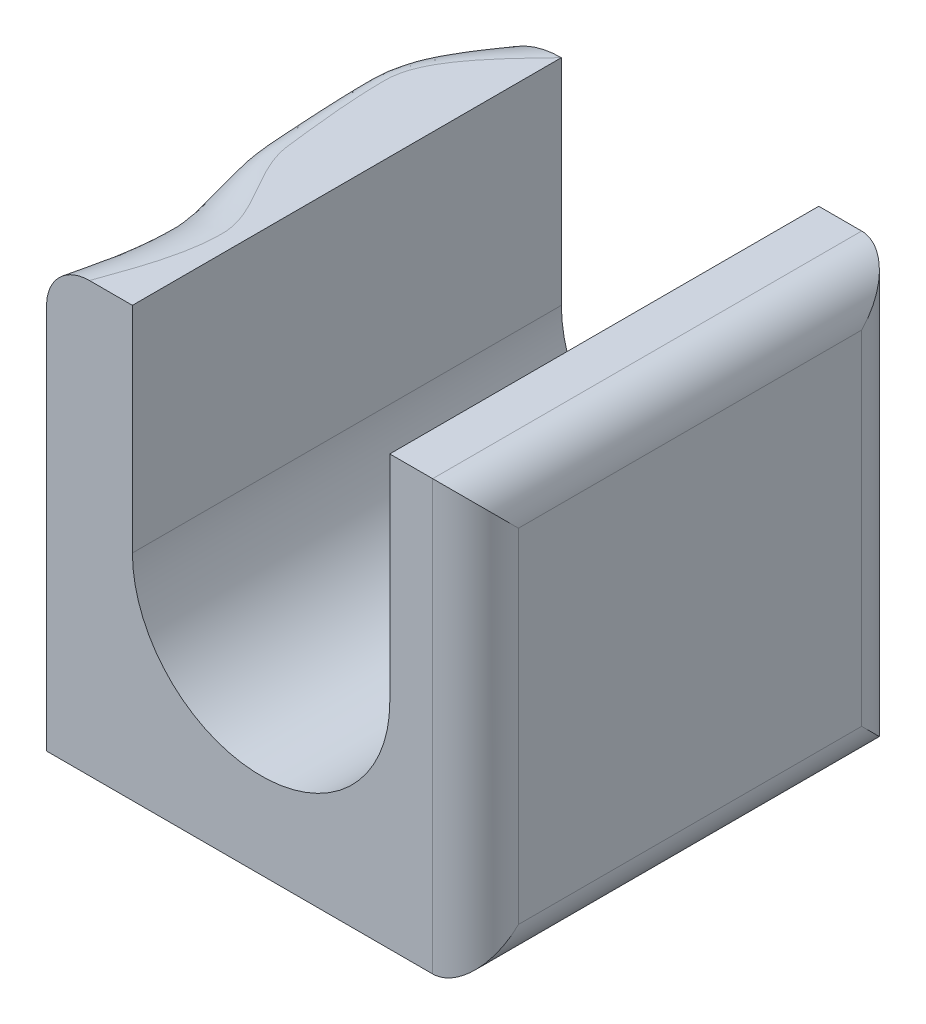
ISO-10303-21;
HEADER;
FILE_DESCRIPTION(('STEP AP214'),'2;1');
FILE_NAME('part.step','',(''),(''),'','','');
FILE_SCHEMA(('AUTOMOTIVE_DESIGN { 1 0 10303 214 1 1 1 1 }'));
ENDSEC;
DATA;
#1=APPLICATION_CONTEXT('core data for automotive mechanical design processes');
#2=APPLICATION_PROTOCOL_DEFINITION('international standard','automotive_design',2000,#1);
#3=PRODUCT_CONTEXT('',#1,'mechanical');
#4=PRODUCT('Part','Part','',(#3));
#5=PRODUCT_RELATED_PRODUCT_CATEGORY('part','',(#4));
#6=PRODUCT_DEFINITION_FORMATION('','',#4);
#7=PRODUCT_DEFINITION_CONTEXT('part definition',#1,'design');
#8=PRODUCT_DEFINITION('design','',#6,#7);
#9=PRODUCT_DEFINITION_SHAPE('','',#8);
#10=(LENGTH_UNIT() NAMED_UNIT(*) SI_UNIT(.MILLI.,.METRE.));
#11=(NAMED_UNIT(*) PLANE_ANGLE_UNIT() SI_UNIT($,.RADIAN.));
#12=(NAMED_UNIT(*) SI_UNIT($,.STERADIAN.) SOLID_ANGLE_UNIT());
#13=UNCERTAINTY_MEASURE_WITH_UNIT(LENGTH_MEASURE(1.E-05),#10,'distance_accuracy_value','');
#14=(GEOMETRIC_REPRESENTATION_CONTEXT(3) GLOBAL_UNCERTAINTY_ASSIGNED_CONTEXT((#13)) GLOBAL_UNIT_ASSIGNED_CONTEXT((#10,
#11,#12)) REPRESENTATION_CONTEXT('',''));
#15=CARTESIAN_POINT('',(0.,0.,0.));
#16=DIRECTION('',(0.,0.,1.));
#17=DIRECTION('',(1.,0.,0.));
#18=AXIS2_PLACEMENT_3D('',#15,#16,#17);
#19=CARTESIAN_POINT('',(0.,25.,50.));
#20=DIRECTION('',(0.,0.,-1.));
#21=DIRECTION('',(-1.,0.,0.));
#22=AXIS2_PLACEMENT_3D('',#19,#20,#21);
#23=CYLINDRICAL_SURFACE('',#22,15.);
#24=DIRECTION('',(0.,0.,1.));
#25=VECTOR('',#24,1.);
#26=CARTESIAN_POINT('',(-15.,25.,50.));
#27=LINE('',#26,#25);
#28=CARTESIAN_POINT('',(-15.,25.,50.));
#29=VERTEX_POINT('',#28);
#30=CARTESIAN_POINT('',(-15.,25.,0.));
#31=VERTEX_POINT('',#30);
#32=EDGE_CURVE('E167',#29,#31,#27,.F.);
#33=ORIENTED_EDGE('',*,*,#32,.F.);
#34=CARTESIAN_POINT('',(0.,25.,50.));
#35=DIRECTION('',(0.,0.,1.));
#36=DIRECTION('',(1.,0.,0.));
#37=AXIS2_PLACEMENT_3D('',#34,#35,#36);
#38=CIRCLE('',#37,15.);
#39=CARTESIAN_POINT('',(15.,25.,50.));
#40=VERTEX_POINT('',#39);
#41=EDGE_CURVE('E183',#29,#40,#38,.T.);
#42=ORIENTED_EDGE('',*,*,#41,.T.);
#43=DIRECTION('',(0.,0.,1.));
#44=VECTOR('',#43,1.);
#45=CARTESIAN_POINT('',(15.,25.,50.));
#46=LINE('',#45,#44);
#47=CARTESIAN_POINT('',(15.,25.,0.));
#48=VERTEX_POINT('',#47);
#49=EDGE_CURVE('E180',#48,#40,#46,.T.);
#50=ORIENTED_EDGE('',*,*,#49,.F.);
#51=CARTESIAN_POINT('',(0.,25.,0.));
#52=DIRECTION('',(0.,0.,1.));
#53=DIRECTION('',(1.,0.,0.));
#54=AXIS2_PLACEMENT_3D('',#51,#52,#53);
#55=CIRCLE('',#54,15.);
#56=EDGE_CURVE('E185',#48,#31,#55,.F.);
#57=ORIENTED_EDGE('',*,*,#56,.T.);
#58=EDGE_LOOP('',(#33,#42,#50,#57));
#59=FACE_BOUND('',#58,.T.);
#60=ADVANCED_FACE('F36',(#59),#23,.F.);
#61=CARTESIAN_POINT('',(-25.,50.,50.));
#62=DIRECTION('',(1.,0.,0.));
#63=DIRECTION('',(0.,1.,0.));
#64=AXIS2_PLACEMENT_3D('',#61,#62,#63);
#65=PLANE('',#64);
#66=DIRECTION('',(0.,-1.,0.));
#67=VECTOR('',#66,1.);
#68=CARTESIAN_POINT('',(-25.,50.,50.));
#69=LINE('',#68,#67);
#70=CARTESIAN_POINT('',(-25.,45.,50.));
#71=VERTEX_POINT('',#70);
#72=CARTESIAN_POINT('',(-25.,0.,50.));
#73=VERTEX_POINT('',#72);
#74=EDGE_CURVE('E120',#71,#73,#69,.T.);
#75=ORIENTED_EDGE('',*,*,#74,.F.);
#76=CARTESIAN_POINT('',(-25.,50.,63.8888888888889));
#77=CARTESIAN_POINT('',(-25.,48.3333333333333,59.2592592592593));
#78=CARTESIAN_POINT('',(-25.,46.6666666666667,54.6296296296296));
#79=CARTESIAN_POINT('',(-25.,45.,50.));
#80=CARTESIAN_POINT('',(-25.,43.5,45.8333333333333));
#81=CARTESIAN_POINT('',(-25.,42.,41.6666666666667));
#82=CARTESIAN_POINT('',(-25.,42.,37.5));
#83=CARTESIAN_POINT('',(-25.,42.,33.3333333333334));
#84=CARTESIAN_POINT('',(-25.,46.5,29.1666666666667));
#85=CARTESIAN_POINT('',(-25.,47.,25.));
#86=CARTESIAN_POINT('',(-25.,47.5,20.8333333333333));
#87=CARTESIAN_POINT('',(-25.,48.,16.6666666666667));
#88=CARTESIAN_POINT('',(-25.,48.,12.5));
#89=CARTESIAN_POINT('',(-25.,48.,8.33333333333334));
#90=CARTESIAN_POINT('',(-25.,44.,4.16666666666668));
#91=CARTESIAN_POINT('',(-25.,40.,0.));
#92=CARTESIAN_POINT('',(-25.,7.99999999999995,-33.3333333333333));
#93=CARTESIAN_POINT('',(-25.,-24.0000000000001,-66.6666666666666));
#94=CARTESIAN_POINT('',(-25.,-56.0000000000001,-99.9999999999999));
#95=(BOUNDED_CURVE() B_SPLINE_CURVE(3,(#76,#77,#78,#79,#80,#81,#82,#83,#84,#85,#86,#87,#88,#89,
#90,#91,#92,#93,#94),.UNSPECIFIED.,.F.,.F.) B_SPLINE_CURVE_WITH_KNOTS((4,3,3,3,3,3,4),
(-0.0138888888888889,0.,0.0125,0.025,0.0375,0.05,0.15),
.UNSPECIFIED.) CURVE() GEOMETRIC_REPRESENTATION_ITEM() RATIONAL_B_SPLINE_CURVE((1.,1.,1.,1.,1.,
1.,1.,1.,1.,1.,1.,1.,1.,1.,1.,1.,1.,1.,1.)) REPRESENTATION_ITEM(''));
#96=CARTESIAN_POINT('',(-25.,40.,0.));
#97=VERTEX_POINT('',#96);
#98=EDGE_CURVE('E187',#71,#97,#95,.T.);
#99=ORIENTED_EDGE('',*,*,#98,.T.);
#100=DIRECTION('',(0.,-1.,0.));
#101=VECTOR('',#100,1.);
#102=CARTESIAN_POINT('',(-25.,50.,0.));
#103=LINE('',#102,#101);
#104=CARTESIAN_POINT('',(-25.,0.,0.));
#105=VERTEX_POINT('',#104);
#106=EDGE_CURVE('E142',#97,#105,#103,.T.);
#107=ORIENTED_EDGE('',*,*,#106,.T.);
#108=DIRECTION('',(0.,0.,-1.));
#109=VECTOR('',#108,1.);
#110=CARTESIAN_POINT('',(-25.,0.,50.));
#111=LINE('',#110,#109);
#112=EDGE_CURVE('E135',#73,#105,#111,.T.);
#113=ORIENTED_EDGE('',*,*,#112,.F.);
#114=EDGE_LOOP('',(#75,#99,#107,#113));
#115=FACE_BOUND('',#114,.T.);
#116=ADVANCED_FACE('F140',(#115),#65,.F.);
#117=CARTESIAN_POINT('',(-25.,0.,50.));
#118=DIRECTION('',(0.,1.,0.));
#119=DIRECTION('',(-1.,0.,0.));
#120=AXIS2_PLACEMENT_3D('',#117,#118,#119);
#121=PLANE('',#120);
#122=DIRECTION('',(1.,0.,0.));
#123=VECTOR('',#122,1.);
#124=CARTESIAN_POINT('',(-25.,0.,0.));
#125=LINE('',#124,#123);
#126=CARTESIAN_POINT('',(20.,0.,0.));
#127=VERTEX_POINT('',#126);
#128=EDGE_CURVE('E265',#105,#127,#125,.T.);
#129=ORIENTED_EDGE('',*,*,#128,.T.);
#130=DIRECTION('',(0.,0.,-1.));
#131=VECTOR('',#130,1.);
#132=CARTESIAN_POINT('',(20.,0.,50.));
#133=LINE('',#132,#131);
#134=CARTESIAN_POINT('',(20.,0.,50.));
#135=VERTEX_POINT('',#134);
#136=EDGE_CURVE('E137',#127,#135,#133,.F.);
#137=ORIENTED_EDGE('',*,*,#136,.T.);
#138=DIRECTION('',(1.,0.,0.));
#139=VECTOR('',#138,1.);
#140=CARTESIAN_POINT('',(-25.,0.,50.));
#141=LINE('',#140,#139);
#142=EDGE_CURVE('E123',#73,#135,#141,.T.);
#143=ORIENTED_EDGE('',*,*,#142,.F.);
#144=ORIENTED_EDGE('',*,*,#112,.T.);
#145=EDGE_LOOP('',(#129,#137,#143,#144));
#146=FACE_BOUND('',#145,.T.);
#147=ADVANCED_FACE('F134',(#146),#121,.F.);
#148=CARTESIAN_POINT('',(25.,0.,50.));
#149=DIRECTION('',(-1.,0.,0.));
#150=DIRECTION('',(0.,0.,1.));
#151=AXIS2_PLACEMENT_3D('',#148,#149,#150);
#152=PLANE('',#151);
#153=DIRECTION('',(0.,1.,0.));
#154=VECTOR('',#153,1.);
#155=CARTESIAN_POINT('',(25.,0.,45.));
#156=LINE('',#155,#154);
#157=CARTESIAN_POINT('',(25.,45.,45.));
#158=VERTEX_POINT('',#157);
#159=CARTESIAN_POINT('',(25.,5.,45.));
#160=VERTEX_POINT('',#159);
#161=EDGE_CURVE('E155',#158,#160,#156,.F.);
#162=ORIENTED_EDGE('',*,*,#161,.T.);
#163=DIRECTION('',(0.,0.,-1.));
#164=VECTOR('',#163,1.);
#165=CARTESIAN_POINT('',(25.,5.,50.));
#166=LINE('',#165,#164);
#167=CARTESIAN_POINT('',(25.,5.,5.));
#168=VERTEX_POINT('',#167);
#169=EDGE_CURVE('E157',#160,#168,#166,.T.);
#170=ORIENTED_EDGE('',*,*,#169,.T.);
#171=DIRECTION('',(0.,1.,0.));
#172=VECTOR('',#171,1.);
#173=CARTESIAN_POINT('',(25.,0.,5.));
#174=LINE('',#173,#172);
#175=CARTESIAN_POINT('',(25.,45.,5.));
#176=VERTEX_POINT('',#175);
#177=EDGE_CURVE('E144',#168,#176,#174,.T.);
#178=ORIENTED_EDGE('',*,*,#177,.T.);
#179=DIRECTION('',(0.,0.,-1.));
#180=VECTOR('',#179,1.);
#181=CARTESIAN_POINT('',(25.,45.,50.));
#182=LINE('',#181,#180);
#183=EDGE_CURVE('E147',#176,#158,#182,.F.);
#184=ORIENTED_EDGE('',*,*,#183,.T.);
#185=EDGE_LOOP('',(#162,#170,#178,#184));
#186=FACE_BOUND('',#185,.T.);
#187=ADVANCED_FACE('F222',(#186),#152,.F.);
#188=CARTESIAN_POINT('',(25.,50.,50.));
#189=DIRECTION('',(0.,-1.,0.));
#190=DIRECTION('',(0.,0.,-1.));
#191=AXIS2_PLACEMENT_3D('',#188,#189,#190);
#192=PLANE('',#191);
#193=DIRECTION('',(-1.,0.,0.));
#194=VECTOR('',#193,1.);
#195=CARTESIAN_POINT('',(25.,50.,50.));
#196=LINE('',#195,#194);
#197=CARTESIAN_POINT('',(20.,50.,50.));
#198=VERTEX_POINT('',#197);
#199=CARTESIAN_POINT('',(15.,50.,50.));
#200=VERTEX_POINT('',#199);
#201=EDGE_CURVE('E138',#198,#200,#196,.T.);
#202=ORIENTED_EDGE('',*,*,#201,.F.);
#203=DIRECTION('',(0.,0.,-1.));
#204=VECTOR('',#203,1.);
#205=CARTESIAN_POINT('',(20.,50.,50.));
#206=LINE('',#205,#204);
#207=CARTESIAN_POINT('',(20.,50.,0.));
#208=VERTEX_POINT('',#207);
#209=EDGE_CURVE('E163',#198,#208,#206,.T.);
#210=ORIENTED_EDGE('',*,*,#209,.T.);
#211=DIRECTION('',(-1.,0.,0.));
#212=VECTOR('',#211,1.);
#213=CARTESIAN_POINT('',(25.,50.,0.));
#214=LINE('',#213,#212);
#215=CARTESIAN_POINT('',(15.,50.,0.));
#216=VERTEX_POINT('',#215);
#217=EDGE_CURVE('E267',#208,#216,#214,.T.);
#218=ORIENTED_EDGE('',*,*,#217,.T.);
#219=DIRECTION('',(0.,0.,-1.));
#220=VECTOR('',#219,1.);
#221=CARTESIAN_POINT('',(15.,50.,50.));
#222=LINE('',#221,#220);
#223=EDGE_CURVE('E145',#200,#216,#222,.T.);
#224=ORIENTED_EDGE('',*,*,#223,.F.);
#225=EDGE_LOOP('',(#202,#210,#218,#224));
#226=FACE_BOUND('',#225,.T.);
#227=ADVANCED_FACE('F218',(#226),#192,.F.);
#228=CARTESIAN_POINT('',(15.,50.,50.));
#229=DIRECTION('',(1.,0.,0.));
#230=DIRECTION('',(0.,1.,0.));
#231=AXIS2_PLACEMENT_3D('',#228,#229,#230);
#232=PLANE('',#231);
#233=DIRECTION('',(0.,-1.,0.));
#234=VECTOR('',#233,1.);
#235=CARTESIAN_POINT('',(15.,50.,0.));
#236=LINE('',#235,#234);
#237=EDGE_CURVE('E269',#216,#48,#236,.T.);
#238=ORIENTED_EDGE('',*,*,#237,.T.);
#239=ORIENTED_EDGE('',*,*,#49,.T.);
#240=DIRECTION('',(0.,-1.,0.));
#241=VECTOR('',#240,1.);
#242=CARTESIAN_POINT('',(15.,50.,50.));
#243=LINE('',#242,#241);
#244=EDGE_CURVE('E257',#200,#40,#243,.T.);
#245=ORIENTED_EDGE('',*,*,#244,.F.);
#246=ORIENTED_EDGE('',*,*,#223,.T.);
#247=EDGE_LOOP('',(#238,#239,#245,#246));
#248=FACE_BOUND('',#247,.T.);
#249=ADVANCED_FACE('F214',(#248),#232,.F.);
#250=CARTESIAN_POINT('',(-15.,10.,50.));
#251=DIRECTION('',(-1.,0.,0.));
#252=DIRECTION('',(0.,-1.,0.));
#253=AXIS2_PLACEMENT_3D('',#250,#251,#252);
#254=PLANE('',#253);
#255=DIRECTION('',(0.,1.,0.));
#256=VECTOR('',#255,1.);
#257=CARTESIAN_POINT('',(-15.,10.,50.));
#258=LINE('',#257,#256);
#259=CARTESIAN_POINT('',(-15.,50.,50.));
#260=VERTEX_POINT('',#259);
#261=EDGE_CURVE('E255',#29,#260,#258,.T.);
#262=ORIENTED_EDGE('',*,*,#261,.F.);
#263=ORIENTED_EDGE('',*,*,#32,.T.);
#264=DIRECTION('',(0.,1.,0.));
#265=VECTOR('',#264,1.);
#266=CARTESIAN_POINT('',(-15.,10.,0.));
#267=LINE('',#266,#265);
#268=CARTESIAN_POINT('',(-15.,50.,0.));
#269=VERTEX_POINT('',#268);
#270=EDGE_CURVE('E128',#31,#269,#267,.T.);
#271=ORIENTED_EDGE('',*,*,#270,.T.);
#272=DIRECTION('',(0.,0.,-1.));
#273=VECTOR('',#272,1.);
#274=CARTESIAN_POINT('',(-15.,50.,50.));
#275=LINE('',#274,#273);
#276=EDGE_CURVE('E150',#260,#269,#275,.T.);
#277=ORIENTED_EDGE('',*,*,#276,.F.);
#278=EDGE_LOOP('',(#262,#263,#271,#277));
#279=FACE_BOUND('',#278,.T.);
#280=ADVANCED_FACE('F211',(#279),#254,.F.);
#281=CARTESIAN_POINT('',(-15.,50.,50.));
#282=DIRECTION('',(0.,-1.,0.));
#283=DIRECTION('',(1.,0.,0.));
#284=AXIS2_PLACEMENT_3D('',#281,#282,#283);
#285=PLANE('',#284);
#286=ORIENTED_EDGE('',*,*,#276,.T.);
#287=CARTESIAN_POINT('',(-25.,50.,63.8888888888889));
#288=CARTESIAN_POINT('',(-23.3333333333334,50.,59.2592592592593));
#289=CARTESIAN_POINT('',(-21.6666666666667,50.,54.6296296296296));
#290=CARTESIAN_POINT('',(-20.,50.,50.));
#291=CARTESIAN_POINT('',(-18.5,50.,45.8333333333333));
#292=CARTESIAN_POINT('',(-17.,50.,41.6666666666667));
#293=CARTESIAN_POINT('',(-17.,50.,37.5));
#294=CARTESIAN_POINT('',(-17.,50.,33.3333333333333));
#295=CARTESIAN_POINT('',(-21.5,50.,29.1666666666667));
#296=CARTESIAN_POINT('',(-22.,50.,25.));
#297=CARTESIAN_POINT('',(-22.5,50.,20.8333333333333));
#298=CARTESIAN_POINT('',(-23.,50.,16.6666666666667));
#299=CARTESIAN_POINT('',(-23.,50.,12.5));
#300=CARTESIAN_POINT('',(-23.,50.,8.33333333333334));
#301=CARTESIAN_POINT('',(-19.,50.,4.16666666666667));
#302=CARTESIAN_POINT('',(-15.,50.,0.));
#303=CARTESIAN_POINT('',(17.,50.,-33.3333333333333));
#304=CARTESIAN_POINT('',(49.0000000000001,50.,-66.6666666666667));
#305=CARTESIAN_POINT('',(81.0000000000001,49.9999999999999,-100.));
#306=(BOUNDED_CURVE() B_SPLINE_CURVE(3,(#287,#288,#289,#290,#291,#292,#293,#294,#295,#296,#297,
#298,#299,#300,#301,#302,#303,#304,#305),.UNSPECIFIED.,.F.,.F.) B_SPLINE_CURVE_WITH_KNOTS((4,3,
3,3,3,3,4),(-0.0138888888888889,0.,0.0125,0.025,0.0375,0.05,0.15),
.UNSPECIFIED.) CURVE() GEOMETRIC_REPRESENTATION_ITEM() RATIONAL_B_SPLINE_CURVE((1.,1.,1.,1.,1.,
1.,1.,1.,1.,1.,1.,1.,1.,1.,1.,1.,1.,1.,1.)) REPRESENTATION_ITEM(''));
#307=CARTESIAN_POINT('',(-20.,50.,50.));
#308=VERTEX_POINT('',#307);
#309=EDGE_CURVE('E51',#269,#308,#306,.F.);
#310=ORIENTED_EDGE('',*,*,#309,.T.);
#311=DIRECTION('',(-1.,0.,0.));
#312=VECTOR('',#311,1.);
#313=CARTESIAN_POINT('',(-15.,50.,50.));
#314=LINE('',#313,#312);
#315=EDGE_CURVE('E256',#260,#308,#314,.T.);
#316=ORIENTED_EDGE('',*,*,#315,.F.);
#317=EDGE_LOOP('',(#286,#310,#316));
#318=FACE_BOUND('',#317,.T.);
#319=ADVANCED_FACE('F208',(#318),#285,.F.);
#320=CARTESIAN_POINT('',(0.,0.,50.));
#321=DIRECTION('',(0.,0.,1.));
#322=DIRECTION('',(1.,0.,0.));
#323=AXIS2_PLACEMENT_3D('',#320,#321,#322);
#324=PLANE('',#323);
#325=ORIENTED_EDGE('',*,*,#315,.T.);
#326=CARTESIAN_POINT('',(-20.,50.,50.));
#327=CARTESIAN_POINT('',(-20.1406302948176,50.0000151222911,50.));
#328=CARTESIAN_POINT('',(-20.2812584191292,49.9940675708119,50.));
#329=CARTESIAN_POINT('',(-20.561508506468,49.9703563419424,50.));
#330=CARTESIAN_POINT('',(-20.7011305174357,49.9525932313667,50.));
#331=CARTESIAN_POINT('',(-20.9782754929708,49.9053779316095,50.));
#332=CARTESIAN_POINT('',(-21.1157999638964,49.8759345850441,50.));
#333=CARTESIAN_POINT('',(-21.3878795188578,49.8055729963046,50.));
#334=CARTESIAN_POINT('',(-21.5224346391194,49.7646548942048,50.));
#335=CARTESIAN_POINT('',(-21.7876613959129,49.671618959448,50.));
#336=CARTESIAN_POINT('',(-21.918331844902,49.619497741274,50.));
#337=CARTESIAN_POINT('',(-22.1748654223634,49.5044123927522,50.));
#338=CARTESIAN_POINT('',(-22.3007267560196,49.4414442615863,50.));
#339=CARTESIAN_POINT('',(-22.5466286145503,49.3051634189843,50.));
#340=CARTESIAN_POINT('',(-22.6666722753307,49.2318563657864,50.));
#341=CARTESIAN_POINT('',(-22.9002023090491,49.0753638289856,50.));
#342=CARTESIAN_POINT('',(-23.0136862505309,48.9921747169174,50.));
#343=CARTESIAN_POINT('',(-23.2332001524479,48.8165646353152,50.));
#344=CARTESIAN_POINT('',(-23.3392329294235,48.7241471864227,50.));
#345=CARTESIAN_POINT('',(-23.5431765690898,48.5306746237598,50.));
#346=CARTESIAN_POINT('',(-23.6410843914719,48.4296163050919,50.));
#347=CARTESIAN_POINT('',(-23.8280220654628,48.2196279177911,50.));
#348=CARTESIAN_POINT('',(-23.9170534060811,48.1106991747091,50.));
#349=CARTESIAN_POINT('',(-24.085653982954,47.8856892756899,50.));
#350=CARTESIAN_POINT('',(-24.1652198430642,47.7696055900085,50.));
#351=CARTESIAN_POINT('',(-24.3142879345645,47.5311441540488,50.));
#352=CARTESIAN_POINT('',(-24.3837900044251,47.4087663027883,50.));
#353=CARTESIAN_POINT('',(-24.5122347393422,47.1585900176992,50.));
#354=CARTESIAN_POINT('',(-24.5711773592955,47.0307915607201,50.));
#355=CARTESIAN_POINT('',(-24.6780583372075,46.7707395834761,50.));
#356=CARTESIAN_POINT('',(-24.7260019741572,46.6384882354878,50.));
#357=CARTESIAN_POINT('',(-24.8105693378674,46.370466334796,50.));
#358=CARTESIAN_POINT('',(-24.8471955295688,46.2346965553993,50.));
#359=CARTESIAN_POINT('',(-24.9185512610603,45.9175367913489,50.));
#360=CARTESIAN_POINT('',(-24.9490935277039,45.7351774636814,50.));
#361=CARTESIAN_POINT('',(-24.9796338141004,45.4601744543481,50.));
#362=CARTESIAN_POINT('',(-24.9872683838864,45.3683094917779,50.));
#363=CARTESIAN_POINT('',(-24.9974508638736,45.1843038851057,50.));
#364=CARTESIAN_POINT('',(-24.9999990959729,45.0921632588193,50.));
#365=CARTESIAN_POINT('',(-25.,45.,50.));
#366=B_SPLINE_CURVE_WITH_KNOTS('',3,(#326,#327,#328,#329,#330,#331,#332,#333,#334,#335,#336,
#337,#338,#339,#340,#341,#342,#343,#344,#345,#346,#347,#348,#349,#350,#351,#352,#353,#354,#355,
#356,#357,#358,#359,#360,#361,#362,#363,#364,#365),.UNSPECIFIED.,.F.,.F.,(4,2,2,2,2,2,2,2,2,2,2,
2,2,2,2,2,2,2,2,4),(0.,0.421762112775048,0.843503994291284,1.26492720019982,1.68634526194463,
2.10789085328559,2.52959226339223,2.95106377581668,3.37269052405383,3.79415703039966,
4.21578054241655,4.63733320863876,5.05903578616029,5.48074513149375,5.90245627805925,
6.32396459781569,6.74538104819376,7.29879231272512,7.57521919596946,7.85162858447806),.UNSPECIFIED.);
#367=EDGE_CURVE('E12',#308,#71,#366,.T.);
#368=ORIENTED_EDGE('',*,*,#367,.T.);
#369=ORIENTED_EDGE('',*,*,#74,.T.);
#370=ORIENTED_EDGE('',*,*,#142,.T.);
#371=DIRECTION('',(0.,1.,0.));
#372=VECTOR('',#371,1.);
#373=CARTESIAN_POINT('',(20.,50.,50.));
#374=LINE('',#373,#372);
#375=EDGE_CURVE('E161',#135,#198,#374,.T.);
#376=ORIENTED_EDGE('',*,*,#375,.T.);
#377=ORIENTED_EDGE('',*,*,#201,.T.);
#378=ORIENTED_EDGE('',*,*,#244,.T.);
#379=ORIENTED_EDGE('',*,*,#41,.F.);
#380=ORIENTED_EDGE('',*,*,#261,.T.);
#381=EDGE_LOOP('',(#325,#368,#369,#370,#376,#377,#378,#379,#380));
#382=FACE_BOUND('',#381,.T.);
#383=ADVANCED_FACE('F122',(#382),#324,.T.);
#384=CARTESIAN_POINT('',(0.,0.,0.));
#385=DIRECTION('',(0.,0.,1.));
#386=DIRECTION('',(1.,0.,0.));
#387=AXIS2_PLACEMENT_3D('',#384,#385,#386);
#388=PLANE('',#387);
#389=ORIENTED_EDGE('',*,*,#106,.F.);
#390=CARTESIAN_POINT('',(-25.,40.,0.));
#391=CARTESIAN_POINT('',(-25.0000184716146,40.2485945690824,0.));
#392=CARTESIAN_POINT('',(-24.9907308615319,40.4971868118128,0.));
#393=CARTESIAN_POINT('',(-24.9536768025844,40.9929819486807,0.));
#394=CARTESIAN_POINT('',(-24.925910996368,41.2401848908349,0.));
#395=CARTESIAN_POINT('',(-24.8520628992933,41.7316409080631,0.));
#396=CARTESIAN_POINT('',(-24.8059950288092,41.9758961499133,0.));
#397=CARTESIAN_POINT('',(-24.6958042040687,42.4602989180155,0.));
#398=CARTESIAN_POINT('',(-24.6316812804001,42.7004464512258,0.));
#399=CARTESIAN_POINT('',(-24.4857281519809,43.1753221449206,0.));
#400=CARTESIAN_POINT('',(-24.4038963959466,43.4100498286347,0.));
#401=CARTESIAN_POINT('',(-24.2229529545884,43.8728399329942,0.));
#402=CARTESIAN_POINT('',(-24.1238353582971,44.1009000423838,0.));
#403=CARTESIAN_POINT('',(-23.9088778541098,44.5490279457088,0.));
#404=CARTESIAN_POINT('',(-23.7930363100546,44.7690949550132,0.));
#405=CARTESIAN_POINT('',(-23.5452826077243,45.199992119846,0.));
#406=CARTESIAN_POINT('',(-23.4133698161739,45.4108219109434,0.));
#407=CARTESIAN_POINT('',(-23.1159135803882,45.8490113618404,0.));
#408=CARTESIAN_POINT('',(-22.9482282038879,46.074921419426,0.));
#409=CARTESIAN_POINT('',(-22.5944152270761,46.5118269764092,0.));
#410=CARTESIAN_POINT('',(-22.408286013955,46.7228211687295,0.));
#411=CARTESIAN_POINT('',(-22.0188653813339,47.1284351865896,0.));
#412=CARTESIAN_POINT('',(-21.8155695985051,47.323050823845,0.));
#413=CARTESIAN_POINT('',(-21.3933016263487,47.6944629838822,0.));
#414=CARTESIAN_POINT('',(-21.1743292651338,47.8712593112313,0.));
#415=CARTESIAN_POINT('',(-20.7222907211773,48.2057563602845,0.));
#416=CARTESIAN_POINT('',(-20.489226007833,48.3634590677332,0.));
#417=CARTESIAN_POINT('',(-20.0106320701015,48.6586730062243,0.));
#418=CARTESIAN_POINT('',(-19.7651025060137,48.7961836865819,0.));
#419=CARTESIAN_POINT('',(-19.2633624574621,49.0500153598147,0.));
#420=CARTESIAN_POINT('',(-19.0071532114439,49.1663388012671,0.));
#421=CARTESIAN_POINT('',(-18.4858547050145,49.3769843196201,0.));
#422=CARTESIAN_POINT('',(-18.2207660168671,49.471307811269,0.));
#423=CARTESIAN_POINT('',(-17.7135544861793,49.6280329863302,0.));
#424=CARTESIAN_POINT('',(-17.4721654342096,49.692820946617,0.));
#425=CARTESIAN_POINT('',(-16.9852289271322,49.8041438301881,0.));
#426=CARTESIAN_POINT('',(-16.7396818248531,49.8506802941746,0.));
#427=CARTESIAN_POINT('',(-16.2458267873535,49.9252327905315,0.));
#428=CARTESIAN_POINT('',(-15.9975192177618,49.9532512466143,0.));
#429=CARTESIAN_POINT('',(-15.4994756248156,49.9906452248723,0.));
#430=CARTESIAN_POINT('',(-15.2497394389855,50.0000185825082,0.));
#431=CARTESIAN_POINT('',(-15.,50.,0.));
#432=B_SPLINE_CURVE_WITH_KNOTS('',3,(#390,#391,#392,#393,#394,#395,#396,#397,#398,#399,#400,
#401,#402,#403,#404,#405,#406,#407,#408,#409,#410,#411,#412,#413,#414,#415,#416,#417,#418,#419,
#420,#421,#422,#423,#424,#425,#426,#427,#428,#429,#430,#431),.UNSPECIFIED.,.F.,.F.,(4,2,2,2,2,2,
2,2,2,2,2,2,2,2,2,2,2,2,2,2,4),(0.,0.745607002474876,1.49118807502578,2.23618285836845,
2.98117637959122,3.72623518825283,4.47154927432953,5.21693632642655,5.96235275944418,
6.8053602726181,7.64844156721147,8.49173780155298,9.33504328371309,10.178260986269,
11.0215016811216,11.8646448620116,12.7077338080394,13.4568455486067,14.205894039196,
14.9548444718428,15.7038818462725),.UNSPECIFIED.);
#433=EDGE_CURVE('E191',#97,#269,#432,.T.);
#434=ORIENTED_EDGE('',*,*,#433,.T.);
#435=ORIENTED_EDGE('',*,*,#270,.F.);
#436=ORIENTED_EDGE('',*,*,#56,.F.);
#437=ORIENTED_EDGE('',*,*,#237,.F.);
#438=ORIENTED_EDGE('',*,*,#217,.F.);
#439=DIRECTION('',(0.,1.,0.));
#440=VECTOR('',#439,1.);
#441=CARTESIAN_POINT('',(20.,0.,0.));
#442=LINE('',#441,#440);
#443=EDGE_CURVE('E165',#208,#127,#442,.F.);
#444=ORIENTED_EDGE('',*,*,#443,.T.);
#445=ORIENTED_EDGE('',*,*,#128,.F.);
#446=EDGE_LOOP('',(#389,#434,#435,#436,#437,#438,#444,#445));
#447=FACE_BOUND('',#446,.T.);
#448=ADVANCED_FACE('F201',(#447),#388,.F.);
#449=CARTESIAN_POINT('',(20.,45.,50.));
#450=DIRECTION('',(0.,0.,-1.));
#451=DIRECTION('',(-1.,0.,0.));
#452=AXIS2_PLACEMENT_3D('',#449,#450,#451);
#453=CYLINDRICAL_SURFACE('',#452,5.);
#454=CARTESIAN_POINT('',(20.,45.,5.));
#455=DIRECTION('',(0.,0.707106781186547,0.707106781186547));
#456=DIRECTION('',(0.,0.707106781186547,-0.707106781186547));
#457=AXIS2_PLACEMENT_3D('',#454,#455,#456);
#458=ELLIPSE('',#457,7.07106781186547,5.);
#459=EDGE_CURVE('E172',#208,#176,#458,.F.);
#460=ORIENTED_EDGE('',*,*,#459,.F.);
#461=ORIENTED_EDGE('',*,*,#209,.F.);
#462=CARTESIAN_POINT('',(20.,45.,45.));
#463=DIRECTION('',(0.,0.707106781186547,-0.707106781186547));
#464=DIRECTION('',(0.,-0.707106781186547,-0.707106781186547));
#465=AXIS2_PLACEMENT_3D('',#462,#463,#464);
#466=ELLIPSE('',#465,7.07106781186547,5.);
#467=EDGE_CURVE('E175',#158,#198,#466,.F.);
#468=ORIENTED_EDGE('',*,*,#467,.F.);
#469=ORIENTED_EDGE('',*,*,#183,.F.);
#470=EDGE_LOOP('',(#460,#461,#468,#469));
#471=FACE_BOUND('',#470,.T.);
#472=ADVANCED_FACE('F205',(#471),#453,.T.);
#473=CARTESIAN_POINT('',(20.,0.,45.));
#474=DIRECTION('',(0.,-1.,0.));
#475=DIRECTION('',(0.,0.,-1.));
#476=AXIS2_PLACEMENT_3D('',#473,#474,#475);
#477=CYLINDRICAL_SURFACE('',#476,5.);
#478=ORIENTED_EDGE('',*,*,#467,.T.);
#479=ORIENTED_EDGE('',*,*,#375,.F.);
#480=CARTESIAN_POINT('',(20.,5.,45.));
#481=DIRECTION('',(0.,-0.707106781186547,-0.707106781186547));
#482=DIRECTION('',(0.,-0.707106781186547,0.707106781186547));
#483=AXIS2_PLACEMENT_3D('',#480,#481,#482);
#484=ELLIPSE('',#483,7.07106781186547,5.);
#485=EDGE_CURVE('E170',#160,#135,#484,.T.);
#486=ORIENTED_EDGE('',*,*,#485,.F.);
#487=ORIENTED_EDGE('',*,*,#161,.F.);
#488=EDGE_LOOP('',(#478,#479,#486,#487));
#489=FACE_BOUND('',#488,.T.);
#490=ADVANCED_FACE('F238',(#489),#477,.T.);
#491=CARTESIAN_POINT('',(20.,0.,5.));
#492=DIRECTION('',(0.,1.,0.));
#493=DIRECTION('',(0.,0.,1.));
#494=AXIS2_PLACEMENT_3D('',#491,#492,#493);
#495=CYLINDRICAL_SURFACE('',#494,5.);
#496=ORIENTED_EDGE('',*,*,#459,.T.);
#497=ORIENTED_EDGE('',*,*,#177,.F.);
#498=CARTESIAN_POINT('',(20.,5.,5.));
#499=DIRECTION('',(0.,0.707106781186547,-0.707106781186547));
#500=DIRECTION('',(0.,0.707106781186547,0.707106781186547));
#501=AXIS2_PLACEMENT_3D('',#498,#499,#500);
#502=ELLIPSE('',#501,7.07106781186547,5.);
#503=EDGE_CURVE('E168',#127,#168,#502,.F.);
#504=ORIENTED_EDGE('',*,*,#503,.F.);
#505=ORIENTED_EDGE('',*,*,#443,.F.);
#506=EDGE_LOOP('',(#496,#497,#504,#505));
#507=FACE_BOUND('',#506,.T.);
#508=ADVANCED_FACE('F234',(#507),#495,.T.);
#509=CARTESIAN_POINT('',(20.,5.,50.));
#510=DIRECTION('',(0.,0.,-1.));
#511=DIRECTION('',(-1.,0.,0.));
#512=AXIS2_PLACEMENT_3D('',#509,#510,#511);
#513=CYLINDRICAL_SURFACE('',#512,5.);
#514=ORIENTED_EDGE('',*,*,#485,.T.);
#515=ORIENTED_EDGE('',*,*,#136,.F.);
#516=ORIENTED_EDGE('',*,*,#503,.T.);
#517=ORIENTED_EDGE('',*,*,#169,.F.);
#518=EDGE_LOOP('',(#514,#515,#516,#517));
#519=FACE_BOUND('',#518,.T.);
#520=ADVANCED_FACE('F231',(#519),#513,.T.);
#521=CARTESIAN_POINT('',(-25.,48.6,60.0000000000001));
#522=CARTESIAN_POINT('',(-25.,47.4,56.6666666666667));
#523=CARTESIAN_POINT('',(-25.,46.2,53.3333333333334));
#524=CARTESIAN_POINT('',(-25.,45.,50.));
#525=CARTESIAN_POINT('',(-25.,43.5,45.8333333333333));
#526=CARTESIAN_POINT('',(-25.,42.,41.6666666666667));
#527=CARTESIAN_POINT('',(-25.,42.,37.5));
#528=CARTESIAN_POINT('',(-25.,42.,33.3333333333334));
#529=CARTESIAN_POINT('',(-25.,46.5,29.1666666666667));
#530=CARTESIAN_POINT('',(-25.,47.,25.));
#531=CARTESIAN_POINT('',(-25.,47.5,20.8333333333333));
#532=CARTESIAN_POINT('',(-25.,48.,16.6666666666667));
#533=CARTESIAN_POINT('',(-25.,48.,12.5));
#534=CARTESIAN_POINT('',(-25.,48.,8.33333333333334));
#535=CARTESIAN_POINT('',(-25.,44.,4.16666666666668));
#536=CARTESIAN_POINT('',(-25.,40.,0.));
#537=CARTESIAN_POINT('',(-25.,36.7999999999999,-3.33333333333344));
#538=CARTESIAN_POINT('',(-25.,33.5999999999997,-6.6666666666669));
#539=CARTESIAN_POINT('',(-25.,30.3999999999996,-10.0000000000004));
#540=CARTESIAN_POINT('',(-25.,50.,60.0000000000001));
#541=CARTESIAN_POINT('',(-25.,50.,56.6666666666667));
#542=CARTESIAN_POINT('',(-25.,50.,53.3333333333334));
#543=CARTESIAN_POINT('',(-25.,50.,50.));
#544=CARTESIAN_POINT('',(-25.,50.,45.8333333333333));
#545=CARTESIAN_POINT('',(-25.,50.,41.6666666666667));
#546=CARTESIAN_POINT('',(-25.,50.,37.5));
#547=CARTESIAN_POINT('',(-25.,50.,33.3333333333333));
#548=CARTESIAN_POINT('',(-25.,50.,29.1666666666667));
#549=CARTESIAN_POINT('',(-25.,50.,25.));
#550=CARTESIAN_POINT('',(-25.,50.,20.8333333333333));
#551=CARTESIAN_POINT('',(-25.,50.,16.6666666666667));
#552=CARTESIAN_POINT('',(-25.,50.,12.5));
#553=CARTESIAN_POINT('',(-25.,50.,8.33333333333334));
#554=CARTESIAN_POINT('',(-25.,50.,4.16666666666667));
#555=CARTESIAN_POINT('',(-25.,50.,0.));
#556=CARTESIAN_POINT('',(-25.,50.,-3.33333333333346));
#557=CARTESIAN_POINT('',(-25.,50.,-6.66666666666692));
#558=CARTESIAN_POINT('',(-25.,50.,-10.0000000000004));
#559=CARTESIAN_POINT('',(-23.6000000000001,50.,60.0000000000001));
#560=CARTESIAN_POINT('',(-22.4,50.,56.6666666666667));
#561=CARTESIAN_POINT('',(-21.2,50.,53.3333333333334));
#562=CARTESIAN_POINT('',(-20.,50.,50.));
#563=CARTESIAN_POINT('',(-18.5,50.,45.8333333333333));
#564=CARTESIAN_POINT('',(-17.,50.,41.6666666666667));
#565=CARTESIAN_POINT('',(-17.,50.,37.5));
#566=CARTESIAN_POINT('',(-17.,50.,33.3333333333333));
#567=CARTESIAN_POINT('',(-21.5,50.,29.1666666666667));
#568=CARTESIAN_POINT('',(-22.,50.,25.));
#569=CARTESIAN_POINT('',(-22.5,50.,20.8333333333333));
#570=CARTESIAN_POINT('',(-23.,50.,16.6666666666667));
#571=CARTESIAN_POINT('',(-23.,50.,12.5));
#572=CARTESIAN_POINT('',(-23.,50.,8.33333333333334));
#573=CARTESIAN_POINT('',(-19.,50.,4.16666666666667));
#574=CARTESIAN_POINT('',(-15.,50.,0.));
#575=CARTESIAN_POINT('',(-11.7999999999999,50.,-3.33333333333346));
#576=CARTESIAN_POINT('',(-8.59999999999975,50.,-6.66666666666692));
#577=CARTESIAN_POINT('',(-5.39999999999963,50.,-10.0000000000004));
#578=(BOUNDED_SURFACE() B_SPLINE_SURFACE(2,3,((#521,#522,#523,#524,#525,#526,#527,#528,#529,
#530,#531,#532,#533,#534,#535,#536,#537,#538,#539),(#540,#541,#542,#543,#544,#545,#546,#547,
#548,#549,#550,#551,#552,#553,#554,#555,#556,#557,#558),(#559,#560,#561,#562,#563,#564,#565,
#566,#567,#568,#569,#570,#571,#572,#573,#574,#575,#576,#577)),.UNSPECIFIED.,.F.,.F.,
.F.) B_SPLINE_SURFACE_WITH_KNOTS((3,3),(4,3,3,3,3,3,4),(0.,1.),(-0.0100000000000001,0.,0.0125,
0.025,0.0375,0.05,0.0600000000000004),
.UNSPECIFIED.) GEOMETRIC_REPRESENTATION_ITEM() RATIONAL_B_SPLINE_SURFACE(((1.,1.,1.,1.,1.,1.,1.,
1.,1.,1.,1.,1.,1.,1.,1.,1.,1.,1.,1.),(0.707106781186547,0.707106781186547,0.707106781186547,
0.707106781186547,0.707106781186547,0.707106781186547,0.707106781186547,0.707106781186547,
0.707106781186547,0.707106781186547,0.707106781186547,0.707106781186547,0.707106781186547,
0.707106781186547,0.707106781186547,0.707106781186547,0.707106781186547,0.707106781186547,
0.707106781186547),(1.,1.,1.,1.,1.,1.,1.,1.,1.,1.,1.,1.,1.,1.,1.,1.,1.,1.,1.))) REPRESENTATION_ITEM('') SURFACE());
#579=ORIENTED_EDGE('',*,*,#367,.F.);
#580=ORIENTED_EDGE('',*,*,#309,.F.);
#581=ORIENTED_EDGE('',*,*,#433,.F.);
#582=ORIENTED_EDGE('',*,*,#98,.F.);
#583=EDGE_LOOP('',(#579,#580,#581,#582));
#584=FACE_BOUND('',#583,.T.);
#585=ADVANCED_FACE('F38',(#584),#578,.T.);
#586=CLOSED_SHELL('',(#60,#116,#147,#187,#227,#249,#280,#319,#383,#448,#472,#490,#508,#520,#585));
#587=MANIFOLD_SOLID_BREP('B2',#586);
#588=ADVANCED_BREP_SHAPE_REPRESENTATION('',(#18,#587),#14);
#589=SHAPE_DEFINITION_REPRESENTATION(#9,#588);
ENDSEC;
END-ISO-10303-21;
